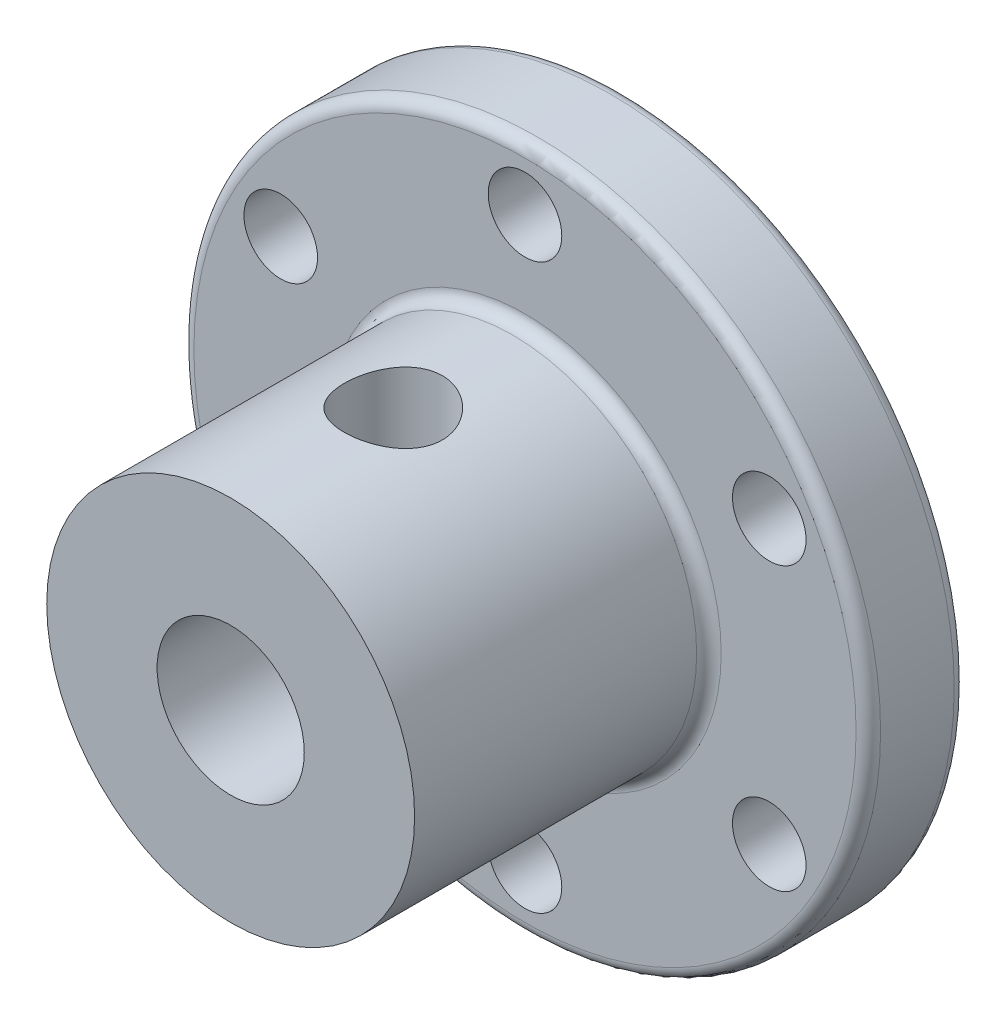
ISO-10303-21;
HEADER;
FILE_DESCRIPTION(('STEP AP214'),'2;1');
FILE_NAME('part.step','',(''),(''),'','','');
FILE_SCHEMA(('AUTOMOTIVE_DESIGN { 1 0 10303 214 1 1 1 1 }'));
ENDSEC;
DATA;
#1=APPLICATION_CONTEXT('core data for automotive mechanical design processes');
#2=APPLICATION_PROTOCOL_DEFINITION('international standard','automotive_design',2000,#1);
#3=PRODUCT_CONTEXT('',#1,'mechanical');
#4=PRODUCT('Part','Part','',(#3));
#5=PRODUCT_RELATED_PRODUCT_CATEGORY('part','',(#4));
#6=PRODUCT_DEFINITION_FORMATION('','',#4);
#7=PRODUCT_DEFINITION_CONTEXT('part definition',#1,'design');
#8=PRODUCT_DEFINITION('design','',#6,#7);
#9=PRODUCT_DEFINITION_SHAPE('','',#8);
#10=(LENGTH_UNIT() NAMED_UNIT(*) SI_UNIT(.MILLI.,.METRE.));
#11=(NAMED_UNIT(*) PLANE_ANGLE_UNIT() SI_UNIT($,.RADIAN.));
#12=(NAMED_UNIT(*) SI_UNIT($,.STERADIAN.) SOLID_ANGLE_UNIT());
#13=UNCERTAINTY_MEASURE_WITH_UNIT(LENGTH_MEASURE(1.E-05),#10,'distance_accuracy_value','');
#14=(GEOMETRIC_REPRESENTATION_CONTEXT(3) GLOBAL_UNCERTAINTY_ASSIGNED_CONTEXT((#13)) GLOBAL_UNIT_ASSIGNED_CONTEXT((#10,
#11,#12)) REPRESENTATION_CONTEXT('',''));
#15=CARTESIAN_POINT('',(0.,0.,0.));
#16=DIRECTION('',(0.,0.,1.));
#17=DIRECTION('',(1.,0.,0.));
#18=AXIS2_PLACEMENT_3D('',#15,#16,#17);
#19=CARTESIAN_POINT('',(0.,0.,16.));
#20=DIRECTION('',(0.,0.,-1.));
#21=DIRECTION('',(-1.,0.,0.));
#22=AXIS2_PLACEMENT_3D('',#19,#20,#21);
#23=CYLINDRICAL_SURFACE('',#22,7.5);
#24=CARTESIAN_POINT('',(0.,0.,4.5));
#25=DIRECTION('',(0.,0.,1.));
#26=DIRECTION('',(1.,0.,0.));
#27=AXIS2_PLACEMENT_3D('',#24,#25,#26);
#28=CIRCLE('',#27,7.5);
#29=CARTESIAN_POINT('',(7.5,0.,4.5));
#30=VERTEX_POINT('',#29);
#31=EDGE_CURVE('E51',#30,#30,#28,.T.);
#32=ORIENTED_EDGE('',*,*,#31,.T.);
#33=EDGE_LOOP('',(#32));
#34=FACE_BOUND('',#33,.T.);
#35=CARTESIAN_POINT('',(0.,0.,16.));
#36=DIRECTION('',(0.,0.,1.));
#37=DIRECTION('',(1.,0.,0.));
#38=AXIS2_PLACEMENT_3D('',#35,#36,#37);
#39=CIRCLE('',#38,7.5);
#40=CARTESIAN_POINT('',(7.5,0.,16.));
#41=VERTEX_POINT('',#40);
#42=EDGE_CURVE('E119',#41,#41,#39,.T.);
#43=ORIENTED_EDGE('',*,*,#42,.F.);
#44=EDGE_LOOP('',(#43));
#45=FACE_BOUND('',#44,.T.);
#46=CARTESIAN_POINT('',(0.,7.5,7.37098431303007));
#47=CARTESIAN_POINT('',(-0.110254555832854,7.49999833810161,7.37098692996492));
#48=CARTESIAN_POINT('',(-0.22053716022184,7.49754486162151,7.38013192721974));
#49=CARTESIAN_POINT('',(-0.437925451354463,7.48799573621659,7.41640554376877));
#50=CARTESIAN_POINT('',(-0.545029583319086,7.48089785332586,7.44354281745619));
#51=CARTESIAN_POINT('',(-0.752891589045311,7.4628433325279,7.5148559798941));
#52=CARTESIAN_POINT('',(-0.853657451015283,7.45189167130375,7.55900990069609));
#53=CARTESIAN_POINT('',(-1.04635368639266,7.42728699151678,7.66302155569669));
#54=CARTESIAN_POINT('',(-1.13828347044962,7.4136337929518,7.72288033638936));
#55=CARTESIAN_POINT('',(-1.31282950374001,7.38474614901995,7.85806782944344));
#56=CARTESIAN_POINT('',(-1.39521168986278,7.36948467678681,7.93369298103833));
#57=CARTESIAN_POINT('',(-1.54628713660638,7.33927409679591,8.09763279609342));
#58=CARTESIAN_POINT('',(-1.61497863495664,7.32432502947243,8.1859490906476));
#59=CARTESIAN_POINT('',(-1.73786409243415,7.29615537464372,8.37463254785552));
#60=CARTESIAN_POINT('',(-1.79178877736487,7.28296888563239,8.4751806412918));
#61=CARTESIAN_POINT('',(-1.88187548076994,7.26021477318187,8.68432442412249));
#62=CARTESIAN_POINT('',(-1.91804077451369,7.25064648253265,8.79291862536151));
#63=CARTESIAN_POINT('',(-1.97076920226504,7.23649115802399,9.01247985085508));
#64=CARTESIAN_POINT('',(-1.98775670244692,7.2317964781149,9.12333785296081));
#65=CARTESIAN_POINT('',(-2.00297034705819,7.22759830916371,9.34642199633661));
#66=CARTESIAN_POINT('',(-2.00119999705753,7.22809385014446,9.45864787805414));
#67=CARTESIAN_POINT('',(-1.97928510002699,7.23412378802031,9.67796972840413));
#68=CARTESIAN_POINT('',(-1.95965406064764,7.23951735511531,9.78512149506856));
#69=CARTESIAN_POINT('',(-1.90339748722183,7.25451013080688,9.99455264748631));
#70=CARTESIAN_POINT('',(-1.86677059492995,7.26410967552612,10.0968316431054));
#71=CARTESIAN_POINT('',(-1.77714356965256,7.28655661748386,10.2949524568386));
#72=CARTESIAN_POINT('',(-1.72396341137784,7.29943942818703,10.3907086523163));
#73=CARTESIAN_POINT('',(-1.60286503823777,7.32698229642445,10.5721184718816));
#74=CARTESIAN_POINT('',(-1.53494392224251,7.34164270355186,10.6577701021865));
#75=CARTESIAN_POINT('',(-1.38366607263419,7.37167510629864,10.8194733104849));
#76=CARTESIAN_POINT('',(-1.29987812728299,7.38705471488831,10.895120631345));
#77=CARTESIAN_POINT('',(-1.12061766820637,7.41636381276316,11.0313730933804));
#78=CARTESIAN_POINT('',(-1.02514469420509,7.43029324488555,11.0919776417325));
#79=CARTESIAN_POINT('',(-0.82459825549745,7.45521820398293,11.1966022158547));
#80=CARTESIAN_POINT('',(-0.719484902551787,7.4662007283356,11.2405490834787));
#81=CARTESIAN_POINT('',(-0.503002294390393,7.48390044400999,11.3100315018434));
#82=CARTESIAN_POINT('',(-0.391634411928322,7.49061856733749,11.335571075754));
#83=CARTESIAN_POINT('',(-0.169254083145514,7.49889158558384,11.3668791899479));
#84=CARTESIAN_POINT('',(-0.0583242376413791,7.50058997470959,11.3731973528809));
#85=CARTESIAN_POINT('',(0.163010045901199,7.49904471691695,11.3674011487831));
#86=CARTESIAN_POINT('',(0.273414537062114,7.49580158080353,11.3552886869243));
#87=CARTESIAN_POINT('',(0.48860244990178,7.48483035496021,11.3134258655701));
#88=CARTESIAN_POINT('',(0.593449852027782,7.47718026546329,11.2839820668323));
#89=CARTESIAN_POINT('',(0.796706971176064,7.45826294894139,11.2086483685221));
#90=CARTESIAN_POINT('',(0.895115989216027,7.44699532996161,11.1627566867795));
#91=CARTESIAN_POINT('',(1.08483847466795,7.42175660559528,11.0548104258495));
#92=CARTESIAN_POINT('',(1.17597518846118,7.40773686604957,10.9924568462323));
#93=CARTESIAN_POINT('',(1.34668463539715,7.37861452365564,10.8537326828721));
#94=CARTESIAN_POINT('',(1.42625507879918,7.3635117072752,10.777359330429));
#95=CARTESIAN_POINT('',(1.57388924478774,7.33339745866705,10.6101987355355));
#96=CARTESIAN_POINT('',(1.64156519249816,7.31840061429312,10.5190657516349));
#97=CARTESIAN_POINT('',(1.76067191185118,7.29066447182727,10.3264196169304));
#98=CARTESIAN_POINT('',(1.81210336122161,7.27792507956316,10.2249068994078));
#99=CARTESIAN_POINT('',(1.89687411586112,7.2562926837321,10.014889005954));
#100=CARTESIAN_POINT('',(1.93031812253957,7.24737748318009,9.90642850121249));
#101=CARTESIAN_POINT('',(1.97841205118791,7.23439825126801,9.68514499335532));
#102=CARTESIAN_POINT('',(1.99306677602478,7.23033298020014,9.57232311268215));
#103=CARTESIAN_POINT('',(2.00288989653714,7.22761744573589,9.34948952514627));
#104=CARTESIAN_POINT('',(1.99868155618108,7.22879397743239,9.23950699277179));
#105=CARTESIAN_POINT('',(1.97234376000439,7.23602396081087,9.02188079902004));
#106=CARTESIAN_POINT('',(1.95021476535025,7.24207728699439,8.91423707752949));
#107=CARTESIAN_POINT('',(1.88902515699699,7.25827571073158,8.70512856090022));
#108=CARTESIAN_POINT('',(1.8500966107558,7.26838885019644,8.60362247029789));
#109=CARTESIAN_POINT('',(1.75651554562386,7.29156818136178,8.40850548249593));
#110=CARTESIAN_POINT('',(1.70186056024616,7.30463483621364,8.31489582672958));
#111=CARTESIAN_POINT('',(1.57648909268817,7.3327292144046,8.13525395353345));
#112=CARTESIAN_POINT('',(1.50534729767909,7.3478033310169,8.04952577805386));
#113=CARTESIAN_POINT('',(1.349830535111,7.37795503783007,7.89102186136274));
#114=CARTESIAN_POINT('',(1.26545235435874,7.39303262798441,7.81824927436123));
#115=CARTESIAN_POINT('',(1.08367998108868,7.42187812403968,7.68619207538321));
#116=CARTESIAN_POINT('',(0.986045961751778,7.43561111314551,7.62722930238074));
#117=CARTESIAN_POINT('',(0.781888640416888,7.45983810102897,7.52664689710071));
#118=CARTESIAN_POINT('',(0.675371094696296,7.47033417683594,7.48501613736647));
#119=CARTESIAN_POINT('',(0.474374704880989,7.48554752513468,7.42570902761456));
#120=CARTESIAN_POINT('',(0.380762016565035,7.49092770592602,7.40523492943758));
#121=CARTESIAN_POINT('',(0.191439795317076,7.49815449036456,7.37787210686301));
#122=CARTESIAN_POINT('',(0.0957304704048601,7.5000014429727,7.37098204083005));
#123=CARTESIAN_POINT('',(0.,7.5,7.37098431303007));
#124=B_SPLINE_CURVE_WITH_KNOTS('',3,(#46,#47,#48,#49,#50,#51,#52,#53,#54,#55,#56,#57,#58,#59,
#60,#61,#62,#63,#64,#65,#66,#67,#68,#69,#70,#71,#72,#73,#74,#75,#76,#77,#78,#79,#80,#81,#82,#83,
#84,#85,#86,#87,#88,#89,#90,#91,#92,#93,#94,#95,#96,#97,#98,#99,#100,#101,#102,#103,#104,#105,
#106,#107,#108,#109,#110,#111,#112,#113,#114,#115,#116,#117,#118,#119,#120,#121,#122,#123),
.UNSPECIFIED.,.T.,.F.,(4,2,2,2,2,2,2,2,2,2,2,2,2,2,2,2,2,2,2,2,2,2,2,2,2,2,2,2,2,2,2,2,2,2,2,2,
2,2,4),(0.,0.330412598949568,0.660984243761449,0.99113055297193,1.32129886708675,
1.65834897954967,1.99544244925149,2.33832582523229,2.68114594129699,3.01622158250468,
3.35123460404319,3.67691002045996,4.00261146812939,4.33198673346498,4.66142688117629,
5.00161259812321,5.34181171937597,5.68348809603041,6.02508977190138,6.35682717524546,
6.6885302892535,7.01453535642115,7.34057575775614,7.67300286004549,8.00549568258886,
8.34736496382788,8.68921998024106,9.02906297699386,9.36881908663982,9.69743342403611,
10.0260393052059,10.352107654483,10.67822717123,11.0139433957139,11.3497412433245,
11.692722522809,12.0354832614518,12.3223981899334,12.6092847796638),.UNSPECIFIED.);
#125=CARTESIAN_POINT('',(0.,7.5,7.37098431303007));
#126=VERTEX_POINT('',#125);
#127=EDGE_CURVE('E131',#126,#126,#124,.T.);
#128=ORIENTED_EDGE('',*,*,#127,.F.);
#129=EDGE_LOOP('',(#128));
#130=FACE_BOUND('',#129,.T.);
#131=ADVANCED_FACE('F37',(#34,#45,#130),#23,.T.);
#132=CARTESIAN_POINT('',(0.,0.,0.));
#133=DIRECTION('',(0.,0.,1.));
#134=DIRECTION('',(1.,0.,0.));
#135=AXIS2_PLACEMENT_3D('',#132,#133,#134);
#136=CYLINDRICAL_SURFACE('',#135,3.);
#137=CARTESIAN_POINT('',(0.,0.,0.));
#138=DIRECTION('',(0.,0.,1.));
#139=DIRECTION('',(1.,0.,0.));
#140=AXIS2_PLACEMENT_3D('',#137,#138,#139);
#141=CIRCLE('',#140,3.);
#142=CARTESIAN_POINT('',(3.,0.,0.));
#143=VERTEX_POINT('',#142);
#144=EDGE_CURVE('E126',#143,#143,#141,.T.);
#145=ORIENTED_EDGE('',*,*,#144,.F.);
#146=EDGE_LOOP('',(#145));
#147=FACE_BOUND('',#146,.T.);
#148=CARTESIAN_POINT('',(0.,0.,16.));
#149=DIRECTION('',(0.,0.,1.));
#150=DIRECTION('',(1.,0.,0.));
#151=AXIS2_PLACEMENT_3D('',#148,#149,#150);
#152=CIRCLE('',#151,3.);
#153=CARTESIAN_POINT('',(3.,0.,16.));
#154=VERTEX_POINT('',#153);
#155=EDGE_CURVE('E127',#154,#154,#152,.T.);
#156=ORIENTED_EDGE('',*,*,#155,.T.);
#157=EDGE_LOOP('',(#156));
#158=FACE_BOUND('',#157,.T.);
#159=CARTESIAN_POINT('',(0.,3.,7.37098431303007));
#160=CARTESIAN_POINT('',(0.100484716668078,3.0000004164484,7.3709837633976));
#161=CARTESIAN_POINT('',(0.200969087132901,2.99490802753388,7.37859828298557));
#162=CARTESIAN_POINT('',(0.39873305803168,2.97504652423809,7.40858117713573));
#163=CARTESIAN_POINT('',(0.496011113955006,2.96027281581235,7.43095655615337));
#164=CARTESIAN_POINT('',(0.684212307854248,2.92250482404708,7.48909203035491));
#165=CARTESIAN_POINT('',(0.775162872657553,2.89954905493315,7.52478945303801));
#166=CARTESIAN_POINT('',(0.949415290997259,2.8472613787744,7.60804767630157));
#167=CARTESIAN_POINT('',(1.03271603160967,2.8179285460551,7.65561019933063));
#168=CARTESIAN_POINT('',(1.19728470077011,2.75227329369838,7.7656412503975));
#169=CARTESIAN_POINT('',(1.27778030546067,2.71556897579319,7.82903217377296));
#170=CARTESIAN_POINT('',(1.42772804469274,2.63982313083466,7.96671436168852));
#171=CARTESIAN_POINT('',(1.49716405543888,2.60077830356832,8.04102124286781));
#172=CARTESIAN_POINT('',(1.63422297745496,2.51728264678794,8.21203668064275));
#173=CARTESIAN_POINT('',(1.6998318636275,2.47295067937795,8.31042996623352));
#174=CARTESIAN_POINT('',(1.81350357014174,2.3908414735282,8.5193476906766));
#175=CARTESIAN_POINT('',(1.86159673426502,2.35305295954668,8.62985071459281));
#176=CARTESIAN_POINT('',(1.92674035011438,2.29976266641461,8.82769560645169));
#177=CARTESIAN_POINT('',(1.94874447236008,2.28097627892403,8.91251276590398));
#178=CARTESIAN_POINT('',(1.98150617785228,2.25257969659604,9.08572881777172));
#179=CARTESIAN_POINT('',(1.99228314651963,2.24295368744148,9.17412126175613));
#180=CARTESIAN_POINT('',(2.00191364141227,2.23436605608045,9.35245909188654));
#181=CARTESIAN_POINT('',(2.00071842917524,2.23544802558503,9.44240933648248));
#182=CARTESIAN_POINT('',(1.98637581333355,2.24819775483425,9.62061928652983));
#183=CARTESIAN_POINT('',(1.97321828380392,2.25987448286881,9.70887749505821));
#184=CARTESIAN_POINT('',(1.93664994217325,2.2912718598996,9.87745136427196));
#185=CARTESIAN_POINT('',(1.91371711479477,2.31061488324375,9.95794564896884));
#186=CARTESIAN_POINT('',(1.85870118583424,2.35509622933624,10.1140080040058));
#187=CARTESIAN_POINT('',(1.8266150732855,2.3802364585489,10.1895744432687));
#188=CARTESIAN_POINT('',(1.74673818732648,2.43964196377947,10.3500097083865));
#189=CARTESIAN_POINT('',(1.69708052300445,2.47472317740627,10.4336442135132));
#190=CARTESIAN_POINT('',(1.5866896043822,2.54691537733438,10.5923677083158));
#191=CARTESIAN_POINT('',(1.52594268999614,2.58402882709328,10.6674459707921));
#192=CARTESIAN_POINT('',(1.37981165322308,2.66543343763725,10.8235268586335));
#193=CARTESIAN_POINT('',(1.29193938283656,2.7095474472056,10.9023183617128));
#194=CARTESIAN_POINT('',(1.10200799908008,2.79218100665212,11.0441808075686));
#195=CARTESIAN_POINT('',(0.999962299343693,2.83070577648042,11.107266458439));
#196=CARTESIAN_POINT('',(0.804857827096526,2.89145404090364,11.2044620316529));
#197=CARTESIAN_POINT('',(0.713957643371906,2.9153926116554,11.241827676369));
#198=CARTESIAN_POINT('',(0.526036043935477,2.95507719030499,11.3030892386554));
#199=CARTESIAN_POINT('',(0.429019879001647,2.97083012127544,11.3269965401623));
#200=CARTESIAN_POINT('',(0.230985453172278,2.99275882156808,11.3601454782681));
#201=CARTESIAN_POINT('',(0.129951811934155,2.99889322461187,11.3693237739683));
#202=CARTESIAN_POINT('',(-0.072441519389349,3.00083114965147,11.3722314015923));
#203=CARTESIAN_POINT('',(-0.173801186186627,2.99663539385634,11.3659618135188));
#204=CARTESIAN_POINT('',(-0.366455717204241,2.97899589424273,11.3393602574681));
#205=CARTESIAN_POINT('',(-0.457957444679195,2.96622246390226,11.3200470152748));
#206=CARTESIAN_POINT('',(-0.636116392427402,2.93318449284837,11.2693886270172));
#207=CARTESIAN_POINT('',(-0.722772837571135,2.91291875746989,11.2380415621019));
#208=CARTESIAN_POINT('',(-0.894664750465998,2.86496352529158,11.1623320159851));
#209=CARTESIAN_POINT('',(-0.97949618463142,2.83689870135785,11.1172961589482));
#210=CARTESIAN_POINT('',(-1.14068302395729,2.77601855611511,11.0165510230838));
#211=CARTESIAN_POINT('',(-1.21703314820091,2.74320030403941,10.9608351524979));
#212=CARTESIAN_POINT('',(-1.37185445482324,2.6695454665343,10.8303764448726));
#213=CARTESIAN_POINT('',(-1.44875187569565,2.62826156800165,10.754018052955));
#214=CARTESIAN_POINT('',(-1.58933968069449,2.54571173085957,10.5898728830729));
#215=CARTESIAN_POINT('',(-1.6530209365723,2.50444582417845,10.5020782739226));
#216=CARTESIAN_POINT('',(-1.76124776549313,2.4293967897058,10.3238419002619));
#217=CARTESIAN_POINT('',(-1.80695636125283,2.39527597025701,10.2342522795679));
#218=CARTESIAN_POINT('',(-1.88496213740264,2.33438974266154,10.0471116605864));
#219=CARTESIAN_POINT('',(-1.91728345682189,2.30761112529822,9.94957537472544));
#220=CARTESIAN_POINT('',(-1.9623584346534,2.26933208182633,9.76641982583465));
#221=CARTESIAN_POINT('',(-1.97758597566225,2.25594998021257,9.68181250315405));
#222=CARTESIAN_POINT('',(-1.99699205923372,2.23879466438398,9.51041103171168));
#223=CARTESIAN_POINT('',(-2.00118260285317,2.23501101347816,9.42361936189057));
#224=CARTESIAN_POINT('',(-1.99823921981266,2.23764201149982,9.25034125630637));
#225=CARTESIAN_POINT('',(-1.99109858767783,2.24406269907463,9.16385503165631));
#226=CARTESIAN_POINT('',(-1.96596997224745,2.26610452403491,8.99364078449795));
#227=CARTESIAN_POINT('',(-1.94796751728257,2.28173793527615,8.90991659920574));
#228=CARTESIAN_POINT('',(-1.89593035657494,2.32526843904801,8.72527312654883));
#229=CARTESIAN_POINT('',(-1.85890187130764,2.35532333574983,8.62571660008674));
#230=CARTESIAN_POINT('',(-1.7708452623622,2.42222161121309,8.43549747864586));
#231=CARTESIAN_POINT('',(-1.71979748341259,2.459074496867,8.34484761503838));
#232=CARTESIAN_POINT('',(-1.60398280555152,2.53617186577119,8.17170242589383));
#233=CARTESIAN_POINT('',(-1.5389830989402,2.5764658739228,8.08938556760702));
#234=CARTESIAN_POINT('',(-1.39671768031094,2.65628301537844,7.93566183477214));
#235=CARTESIAN_POINT('',(-1.31944821025748,2.69580590832397,7.86425831600086));
#236=CARTESIAN_POINT('',(-1.14145732976973,2.77631551964083,7.72427220872098));
#237=CARTESIAN_POINT('',(-1.03896166955574,2.81669805449991,7.65756567285175));
#238=CARTESIAN_POINT('',(-0.820868555771208,2.88777665874161,7.54307103636477));
#239=CARTESIAN_POINT('',(-0.705292062449148,2.91848793445255,7.49525320620612));
#240=CARTESIAN_POINT('',(-0.491435069835739,2.96101644836896,7.42982973486629));
#241=CARTESIAN_POINT('',(-0.395012325257916,2.97551480368935,7.40787327393145));
#242=CARTESIAN_POINT('',(-0.199058012023943,2.99500280141853,7.37845628049197));
#243=CARTESIAN_POINT('',(-0.0995288361880065,2.99999958751315,7.37098485743406));
#244=CARTESIAN_POINT('',(0.,3.,7.37098431303007));
#245=B_SPLINE_CURVE_WITH_KNOTS('',3,(#159,#160,#161,#162,#163,#164,#165,#166,#167,#168,#169,
#170,#171,#172,#173,#174,#175,#176,#177,#178,#179,#180,#181,#182,#183,#184,#185,#186,#187,#188,
#189,#190,#191,#192,#193,#194,#195,#196,#197,#198,#199,#200,#201,#202,#203,#204,#205,#206,#207,
#208,#209,#210,#211,#212,#213,#214,#215,#216,#217,#218,#219,#220,#221,#222,#223,#224,#225,#226,
#227,#228,#229,#230,#231,#232,#233,#234,#235,#236,#237,#238,#239,#240,#241,#242,#243,#244),
.UNSPECIFIED.,.T.,.F.,(4,2,2,2,2,2,2,2,2,2,2,2,2,2,2,2,2,2,2,2,2,2,2,2,2,2,2,2,2,2,2,2,2,2,2,2,
2,2,2,2,2,2,4),(0.,0.301053226505399,0.602249414348688,0.902046153190231,1.20188643867386,
1.52717029000556,1.85292411604318,2.23006683295982,2.60655305445439,2.87433693676029,
3.14165767845809,3.41006711735378,3.67870397263352,3.93548862198022,4.19235783805078,
4.50147574660873,4.81097703780057,5.18718954496752,5.56304840301362,5.86524087696758,
6.16717735142813,6.4704088329425,6.77361911533414,7.05553084792472,7.3374875513827,
7.63652346829516,7.93574454945203,8.28228176141291,8.62905753175757,8.94649935304476,
9.26336626640722,9.52324048016134,9.7828320033309,10.0425772028455,10.302669238524,
10.6320660870419,10.9619271337795,11.2977924520448,11.6337608397015,12.0179535155883,
12.4015390656082,12.6999529136674,12.9981423125957),.UNSPECIFIED.);
#246=CARTESIAN_POINT('',(0.,3.,7.37098431303007));
#247=VERTEX_POINT('',#246);
#248=EDGE_CURVE('E41',#247,#247,#245,.T.);
#249=ORIENTED_EDGE('',*,*,#248,.F.);
#250=EDGE_LOOP('',(#249));
#251=FACE_BOUND('',#250,.T.);
#252=ADVANCED_FACE('F148',(#147,#158,#251),#136,.F.);
#253=CARTESIAN_POINT('',(0.,0.,4.));
#254=DIRECTION('',(0.,0.,1.));
#255=DIRECTION('',(1.,0.,0.));
#256=AXIS2_PLACEMENT_3D('',#253,#254,#255);
#257=PLANE('',#256);
#258=CARTESIAN_POINT('',(0.,0.,4.));
#259=DIRECTION('',(0.,0.,1.));
#260=DIRECTION('',(1.,0.,0.));
#261=AXIS2_PLACEMENT_3D('',#258,#259,#260);
#262=CIRCLE('',#261,8.);
#263=CARTESIAN_POINT('',(8.,0.,4.));
#264=VERTEX_POINT('',#263);
#265=EDGE_CURVE('E10',#264,#264,#262,.F.);
#266=ORIENTED_EDGE('',*,*,#265,.T.);
#267=EDGE_LOOP('',(#266));
#268=FACE_BOUND('',#267,.T.);
#269=CARTESIAN_POINT('',(0.,0.,4.));
#270=DIRECTION('',(0.,0.,1.));
#271=DIRECTION('',(1.,0.,0.));
#272=AXIS2_PLACEMENT_3D('',#269,#270,#271);
#273=CIRCLE('',#272,13.5);
#274=CARTESIAN_POINT('',(13.5,0.,4.));
#275=VERTEX_POINT('',#274);
#276=EDGE_CURVE('E70',#275,#275,#273,.T.);
#277=ORIENTED_EDGE('',*,*,#276,.T.);
#278=EDGE_LOOP('',(#277));
#279=FACE_BOUND('',#278,.T.);
#280=CARTESIAN_POINT('',(-9.95929214352006,-5.75000000000057,4.));
#281=DIRECTION('',(0.,0.,1.));
#282=DIRECTION('',(1.,0.,0.));
#283=AXIS2_PLACEMENT_3D('',#280,#281,#282);
#284=CIRCLE('',#283,1.5000000000012);
#285=CARTESIAN_POINT('',(-8.45929214351886,-5.75000000000057,4.));
#286=VERTEX_POINT('',#285);
#287=EDGE_CURVE('E103',#286,#286,#284,.T.);
#288=ORIENTED_EDGE('',*,*,#287,.F.);
#289=EDGE_LOOP('',(#288));
#290=FACE_BOUND('',#289,.T.);
#291=CARTESIAN_POINT('',(9.95929214352202,-5.74999999999943,4.));
#292=DIRECTION('',(0.,0.,1.));
#293=DIRECTION('',(1.,0.,0.));
#294=AXIS2_PLACEMENT_3D('',#291,#292,#293);
#295=CIRCLE('',#294,1.50000000000082);
#296=CARTESIAN_POINT('',(11.4592921435228,-5.74999999999943,4.));
#297=VERTEX_POINT('',#296);
#298=EDGE_CURVE('E87',#297,#297,#295,.T.);
#299=ORIENTED_EDGE('',*,*,#298,.F.);
#300=EDGE_LOOP('',(#299));
#301=FACE_BOUND('',#300,.T.);
#302=CARTESIAN_POINT('',(0.,11.5,4.));
#303=DIRECTION('',(0.,0.,1.));
#304=DIRECTION('',(1.,0.,0.));
#305=AXIS2_PLACEMENT_3D('',#302,#303,#304);
#306=CIRCLE('',#305,1.5);
#307=CARTESIAN_POINT('',(1.5,11.5,4.));
#308=VERTEX_POINT('',#307);
#309=EDGE_CURVE('E74',#308,#308,#306,.T.);
#310=ORIENTED_EDGE('',*,*,#309,.F.);
#311=EDGE_LOOP('',(#310));
#312=FACE_BOUND('',#311,.T.);
#313=CARTESIAN_POINT('',(9.95929214352137,5.75000000000057,4.));
#314=DIRECTION('',(0.,0.,1.));
#315=DIRECTION('',(1.,0.,0.));
#316=AXIS2_PLACEMENT_3D('',#313,#314,#315);
#317=CIRCLE('',#316,1.50000000000017);
#318=CARTESIAN_POINT('',(11.4592921435215,5.75000000000057,4.));
#319=VERTEX_POINT('',#318);
#320=EDGE_CURVE('E79',#319,#319,#317,.T.);
#321=ORIENTED_EDGE('',*,*,#320,.F.);
#322=EDGE_LOOP('',(#321));
#323=FACE_BOUND('',#322,.T.);
#324=CARTESIAN_POINT('',(1.30458194616055E-12,-11.5,4.));
#325=DIRECTION('',(0.,0.,1.));
#326=DIRECTION('',(1.,0.,0.));
#327=AXIS2_PLACEMENT_3D('',#324,#325,#326);
#328=CIRCLE('',#327,1.50000000000132);
#329=CARTESIAN_POINT('',(1.50000000000263,-11.5,4.));
#330=VERTEX_POINT('',#329);
#331=EDGE_CURVE('E95',#330,#330,#328,.T.);
#332=ORIENTED_EDGE('',*,*,#331,.F.);
#333=EDGE_LOOP('',(#332));
#334=FACE_BOUND('',#333,.T.);
#335=CARTESIAN_POINT('',(-9.95929214352072,5.74999999999943,4.));
#336=DIRECTION('',(0.,0.,1.));
#337=DIRECTION('',(1.,0.,0.));
#338=AXIS2_PLACEMENT_3D('',#335,#336,#337);
#339=CIRCLE('',#338,1.50000000000061);
#340=CARTESIAN_POINT('',(-8.45929214352011,5.74999999999943,4.));
#341=VERTEX_POINT('',#340);
#342=EDGE_CURVE('E111',#341,#341,#339,.T.);
#343=ORIENTED_EDGE('',*,*,#342,.F.);
#344=EDGE_LOOP('',(#343));
#345=FACE_BOUND('',#344,.T.);
#346=ADVANCED_FACE('F152',(#268,#279,#290,#301,#312,#323,#334,#345),#257,.T.);
#347=CARTESIAN_POINT('',(0.,0.,0.));
#348=DIRECTION('',(0.,0.,1.));
#349=DIRECTION('',(1.,0.,0.));
#350=AXIS2_PLACEMENT_3D('',#347,#348,#349);
#351=PLANE('',#350);
#352=CARTESIAN_POINT('',(0.,0.,0.));
#353=DIRECTION('',(0.,0.,1.));
#354=DIRECTION('',(1.,0.,0.));
#355=AXIS2_PLACEMENT_3D('',#352,#353,#354);
#356=CIRCLE('',#355,13.5);
#357=CARTESIAN_POINT('',(13.5,0.,0.));
#358=VERTEX_POINT('',#357);
#359=EDGE_CURVE('E56',#358,#358,#356,.F.);
#360=ORIENTED_EDGE('',*,*,#359,.T.);
#361=EDGE_LOOP('',(#360));
#362=FACE_BOUND('',#361,.T.);
#363=ORIENTED_EDGE('',*,*,#144,.T.);
#364=EDGE_LOOP('',(#363));
#365=FACE_BOUND('',#364,.T.);
#366=CARTESIAN_POINT('',(0.,11.5,0.));
#367=DIRECTION('',(0.,0.,1.));
#368=DIRECTION('',(1.,0.,0.));
#369=AXIS2_PLACEMENT_3D('',#366,#367,#368);
#370=CIRCLE('',#369,1.5);
#371=CARTESIAN_POINT('',(1.5,11.5,0.));
#372=VERTEX_POINT('',#371);
#373=EDGE_CURVE('E75',#372,#372,#370,.T.);
#374=ORIENTED_EDGE('',*,*,#373,.T.);
#375=EDGE_LOOP('',(#374));
#376=FACE_BOUND('',#375,.T.);
#377=CARTESIAN_POINT('',(9.95929214352137,5.75000000000057,0.));
#378=DIRECTION('',(0.,0.,1.));
#379=DIRECTION('',(1.,0.,0.));
#380=AXIS2_PLACEMENT_3D('',#377,#378,#379);
#381=CIRCLE('',#380,1.50000000000017);
#382=CARTESIAN_POINT('',(11.4592921435215,5.75000000000057,0.));
#383=VERTEX_POINT('',#382);
#384=EDGE_CURVE('E83',#383,#383,#381,.T.);
#385=ORIENTED_EDGE('',*,*,#384,.T.);
#386=EDGE_LOOP('',(#385));
#387=FACE_BOUND('',#386,.T.);
#388=CARTESIAN_POINT('',(9.95929214352202,-5.74999999999943,0.));
#389=DIRECTION('',(0.,0.,1.));
#390=DIRECTION('',(1.,0.,0.));
#391=AXIS2_PLACEMENT_3D('',#388,#389,#390);
#392=CIRCLE('',#391,1.50000000000082);
#393=CARTESIAN_POINT('',(11.4592921435228,-5.74999999999943,0.));
#394=VERTEX_POINT('',#393);
#395=EDGE_CURVE('E91',#394,#394,#392,.T.);
#396=ORIENTED_EDGE('',*,*,#395,.T.);
#397=EDGE_LOOP('',(#396));
#398=FACE_BOUND('',#397,.T.);
#399=CARTESIAN_POINT('',(1.30458194616055E-12,-11.5,0.));
#400=DIRECTION('',(0.,0.,1.));
#401=DIRECTION('',(1.,0.,0.));
#402=AXIS2_PLACEMENT_3D('',#399,#400,#401);
#403=CIRCLE('',#402,1.50000000000132);
#404=CARTESIAN_POINT('',(1.50000000000263,-11.5,0.));
#405=VERTEX_POINT('',#404);
#406=EDGE_CURVE('E99',#405,#405,#403,.T.);
#407=ORIENTED_EDGE('',*,*,#406,.T.);
#408=EDGE_LOOP('',(#407));
#409=FACE_BOUND('',#408,.T.);
#410=CARTESIAN_POINT('',(-9.95929214352006,-5.75000000000057,0.));
#411=DIRECTION('',(0.,0.,1.));
#412=DIRECTION('',(1.,0.,0.));
#413=AXIS2_PLACEMENT_3D('',#410,#411,#412);
#414=CIRCLE('',#413,1.5000000000012);
#415=CARTESIAN_POINT('',(-8.45929214351886,-5.75000000000057,0.));
#416=VERTEX_POINT('',#415);
#417=EDGE_CURVE('E107',#416,#416,#414,.T.);
#418=ORIENTED_EDGE('',*,*,#417,.T.);
#419=EDGE_LOOP('',(#418));
#420=FACE_BOUND('',#419,.T.);
#421=CARTESIAN_POINT('',(-9.95929214352072,5.74999999999943,0.));
#422=DIRECTION('',(0.,0.,1.));
#423=DIRECTION('',(1.,0.,0.));
#424=AXIS2_PLACEMENT_3D('',#421,#422,#423);
#425=CIRCLE('',#424,1.50000000000061);
#426=CARTESIAN_POINT('',(-8.45929214352011,5.74999999999943,0.));
#427=VERTEX_POINT('',#426);
#428=EDGE_CURVE('E115',#427,#427,#425,.T.);
#429=ORIENTED_EDGE('',*,*,#428,.T.);
#430=EDGE_LOOP('',(#429));
#431=FACE_BOUND('',#430,.T.);
#432=ADVANCED_FACE('F196',(#362,#365,#376,#387,#398,#409,#420,#431),#351,.F.);
#433=CARTESIAN_POINT('',(0.,0.,4.));
#434=DIRECTION('',(0.,0.,-1.));
#435=DIRECTION('',(-1.,0.,0.));
#436=AXIS2_PLACEMENT_3D('',#433,#434,#435);
#437=CYLINDRICAL_SURFACE('',#436,14.);
#438=CARTESIAN_POINT('',(0.,0.,3.5));
#439=DIRECTION('',(0.,0.,1.));
#440=DIRECTION('',(1.,0.,0.));
#441=AXIS2_PLACEMENT_3D('',#438,#439,#440);
#442=CIRCLE('',#441,14.);
#443=CARTESIAN_POINT('',(14.,0.,3.5));
#444=VERTEX_POINT('',#443);
#445=EDGE_CURVE('E62',#444,#444,#442,.F.);
#446=ORIENTED_EDGE('',*,*,#445,.T.);
#447=EDGE_LOOP('',(#446));
#448=FACE_BOUND('',#447,.T.);
#449=CARTESIAN_POINT('',(0.,0.,0.5));
#450=DIRECTION('',(0.,0.,1.));
#451=DIRECTION('',(1.,0.,0.));
#452=AXIS2_PLACEMENT_3D('',#449,#450,#451);
#453=CIRCLE('',#452,14.);
#454=CARTESIAN_POINT('',(14.,0.,0.5));
#455=VERTEX_POINT('',#454);
#456=EDGE_CURVE('E66',#455,#455,#453,.T.);
#457=ORIENTED_EDGE('',*,*,#456,.T.);
#458=EDGE_LOOP('',(#457));
#459=FACE_BOUND('',#458,.T.);
#460=ADVANCED_FACE('F192',(#448,#459),#437,.T.);
#461=CARTESIAN_POINT('',(0.,11.5,4.));
#462=DIRECTION('',(0.,0.,-1.));
#463=DIRECTION('',(-1.,0.,0.));
#464=AXIS2_PLACEMENT_3D('',#461,#462,#463);
#465=CYLINDRICAL_SURFACE('',#464,1.5);
#466=ORIENTED_EDGE('',*,*,#309,.T.);
#467=EDGE_LOOP('',(#466));
#468=FACE_BOUND('',#467,.T.);
#469=ORIENTED_EDGE('',*,*,#373,.F.);
#470=EDGE_LOOP('',(#469));
#471=FACE_BOUND('',#470,.T.);
#472=ADVANCED_FACE('F195',(#468,#471),#465,.F.);
#473=CARTESIAN_POINT('',(9.95929214352137,5.75000000000057,4.));
#474=DIRECTION('',(0.,0.,-1.));
#475=DIRECTION('',(-1.,0.,0.));
#476=AXIS2_PLACEMENT_3D('',#473,#474,#475);
#477=CYLINDRICAL_SURFACE('',#476,1.50000000000017);
#478=ORIENTED_EDGE('',*,*,#320,.T.);
#479=EDGE_LOOP('',(#478));
#480=FACE_BOUND('',#479,.T.);
#481=ORIENTED_EDGE('',*,*,#384,.F.);
#482=EDGE_LOOP('',(#481));
#483=FACE_BOUND('',#482,.T.);
#484=ADVANCED_FACE('F205',(#480,#483),#477,.F.);
#485=CARTESIAN_POINT('',(9.95929214352202,-5.74999999999943,4.));
#486=DIRECTION('',(0.,0.,-1.));
#487=DIRECTION('',(-1.,0.,0.));
#488=AXIS2_PLACEMENT_3D('',#485,#486,#487);
#489=CYLINDRICAL_SURFACE('',#488,1.50000000000082);
#490=ORIENTED_EDGE('',*,*,#298,.T.);
#491=EDGE_LOOP('',(#490));
#492=FACE_BOUND('',#491,.T.);
#493=ORIENTED_EDGE('',*,*,#395,.F.);
#494=EDGE_LOOP('',(#493));
#495=FACE_BOUND('',#494,.T.);
#496=ADVANCED_FACE('F209',(#492,#495),#489,.F.);
#497=CARTESIAN_POINT('',(1.30458194616055E-12,-11.5,4.));
#498=DIRECTION('',(0.,0.,-1.));
#499=DIRECTION('',(-1.,0.,0.));
#500=AXIS2_PLACEMENT_3D('',#497,#498,#499);
#501=CYLINDRICAL_SURFACE('',#500,1.50000000000132);
#502=ORIENTED_EDGE('',*,*,#331,.T.);
#503=EDGE_LOOP('',(#502));
#504=FACE_BOUND('',#503,.T.);
#505=ORIENTED_EDGE('',*,*,#406,.F.);
#506=EDGE_LOOP('',(#505));
#507=FACE_BOUND('',#506,.T.);
#508=ADVANCED_FACE('F213',(#504,#507),#501,.F.);
#509=CARTESIAN_POINT('',(-9.95929214352006,-5.75000000000057,4.));
#510=DIRECTION('',(0.,0.,-1.));
#511=DIRECTION('',(-1.,0.,0.));
#512=AXIS2_PLACEMENT_3D('',#509,#510,#511);
#513=CYLINDRICAL_SURFACE('',#512,1.5000000000012);
#514=ORIENTED_EDGE('',*,*,#287,.T.);
#515=EDGE_LOOP('',(#514));
#516=FACE_BOUND('',#515,.T.);
#517=ORIENTED_EDGE('',*,*,#417,.F.);
#518=EDGE_LOOP('',(#517));
#519=FACE_BOUND('',#518,.T.);
#520=ADVANCED_FACE('F166',(#516,#519),#513,.F.);
#521=CARTESIAN_POINT('',(-9.95929214352072,5.74999999999943,4.));
#522=DIRECTION('',(0.,0.,-1.));
#523=DIRECTION('',(-1.,0.,0.));
#524=AXIS2_PLACEMENT_3D('',#521,#522,#523);
#525=CYLINDRICAL_SURFACE('',#524,1.50000000000061);
#526=ORIENTED_EDGE('',*,*,#342,.T.);
#527=EDGE_LOOP('',(#526));
#528=FACE_BOUND('',#527,.T.);
#529=ORIENTED_EDGE('',*,*,#428,.F.);
#530=EDGE_LOOP('',(#529));
#531=FACE_BOUND('',#530,.T.);
#532=ADVANCED_FACE('F157',(#528,#531),#525,.F.);
#533=CARTESIAN_POINT('',(0.,0.,16.));
#534=DIRECTION('',(0.,0.,1.));
#535=DIRECTION('',(1.,0.,0.));
#536=AXIS2_PLACEMENT_3D('',#533,#534,#535);
#537=PLANE('',#536);
#538=ORIENTED_EDGE('',*,*,#155,.F.);
#539=EDGE_LOOP('',(#538));
#540=FACE_BOUND('',#539,.T.);
#541=ORIENTED_EDGE('',*,*,#42,.T.);
#542=EDGE_LOOP('',(#541));
#543=FACE_BOUND('',#542,.T.);
#544=ADVANCED_FACE('F154',(#540,#543),#537,.T.);
#545=CARTESIAN_POINT('',(0.,0.,3.5));
#546=DIRECTION('',(0.,0.,1.));
#547=DIRECTION('',(1.,0.,0.));
#548=AXIS2_PLACEMENT_3D('',#545,#546,#547);
#549=TOROIDAL_SURFACE('',#548,13.5,0.5);
#550=ORIENTED_EDGE('',*,*,#445,.F.);
#551=EDGE_LOOP('',(#550));
#552=FACE_BOUND('',#551,.T.);
#553=ORIENTED_EDGE('',*,*,#276,.F.);
#554=EDGE_LOOP('',(#553));
#555=FACE_BOUND('',#554,.T.);
#556=ADVANCED_FACE('F156',(#552,#555),#549,.T.);
#557=CARTESIAN_POINT('',(0.,0.,0.5));
#558=DIRECTION('',(0.,0.,1.));
#559=DIRECTION('',(1.,0.,0.));
#560=AXIS2_PLACEMENT_3D('',#557,#558,#559);
#561=TOROIDAL_SURFACE('',#560,13.5,0.5);
#562=ORIENTED_EDGE('',*,*,#359,.F.);
#563=EDGE_LOOP('',(#562));
#564=FACE_BOUND('',#563,.T.);
#565=ORIENTED_EDGE('',*,*,#456,.F.);
#566=EDGE_LOOP('',(#565));
#567=FACE_BOUND('',#566,.T.);
#568=ADVANCED_FACE('F163',(#564,#567),#561,.T.);
#569=CARTESIAN_POINT('',(0.,0.,4.5));
#570=DIRECTION('',(0.,0.,1.));
#571=DIRECTION('',(1.,0.,0.));
#572=AXIS2_PLACEMENT_3D('',#569,#570,#571);
#573=TOROIDAL_SURFACE('',#572,8.,0.5);
#574=ORIENTED_EDGE('',*,*,#265,.F.);
#575=EDGE_LOOP('',(#574));
#576=FACE_BOUND('',#575,.T.);
#577=ORIENTED_EDGE('',*,*,#31,.F.);
#578=EDGE_LOOP('',(#577));
#579=FACE_BOUND('',#578,.T.);
#580=ADVANCED_FACE('F39',(#576,#579),#573,.F.);
#581=CARTESIAN_POINT('',(0.,14.,9.37098431303007));
#582=DIRECTION('',(0.,-1.,0.));
#583=DIRECTION('',(0.,0.,-1.));
#584=AXIS2_PLACEMENT_3D('',#581,#582,#583);
#585=CYLINDRICAL_SURFACE('',#584,2.);
#586=ORIENTED_EDGE('',*,*,#248,.T.);
#587=EDGE_LOOP('',(#586));
#588=FACE_BOUND('',#587,.T.);
#589=ORIENTED_EDGE('',*,*,#127,.T.);
#590=EDGE_LOOP('',(#589));
#591=FACE_BOUND('',#590,.T.);
#592=ADVANCED_FACE('F144',(#588,#591),#585,.F.);
#593=CLOSED_SHELL('',(#131,#252,#346,#432,#460,#472,#484,#496,#508,#520,#532,#544,#556,#568,
#580,#592));
#594=MANIFOLD_SOLID_BREP('B2',#593);
#595=ADVANCED_BREP_SHAPE_REPRESENTATION('',(#18,#594),#14);
#596=SHAPE_DEFINITION_REPRESENTATION(#9,#595);
ENDSEC;
END-ISO-10303-21;
